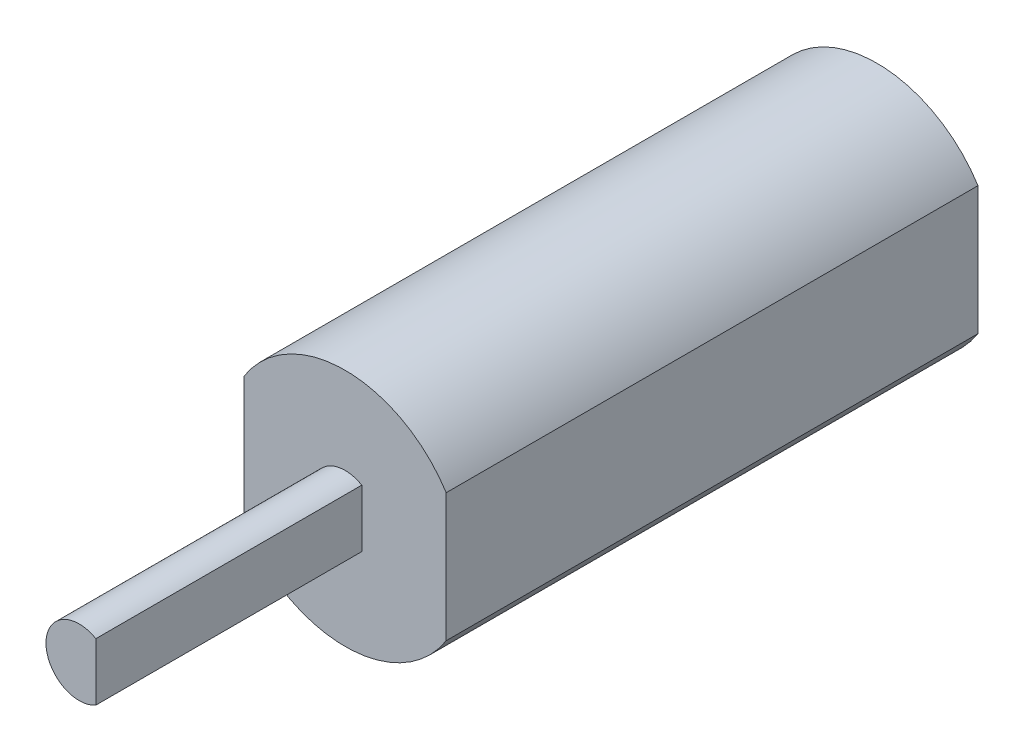
ISO-10303-21;
HEADER;
FILE_DESCRIPTION(('STEP AP214'),'2;1');
FILE_NAME('part.step','',(''),(''),'','','');
FILE_SCHEMA(('AUTOMOTIVE_DESIGN { 1 0 10303 214 1 1 1 1 }'));
ENDSEC;
DATA;
#1=APPLICATION_CONTEXT('core data for automotive mechanical design processes');
#2=APPLICATION_PROTOCOL_DEFINITION('international standard','automotive_design',2000,#1);
#3=PRODUCT_CONTEXT('',#1,'mechanical');
#4=PRODUCT('Part','Part','',(#3));
#5=PRODUCT_RELATED_PRODUCT_CATEGORY('part','',(#4));
#6=PRODUCT_DEFINITION_FORMATION('','',#4);
#7=PRODUCT_DEFINITION_CONTEXT('part definition',#1,'design');
#8=PRODUCT_DEFINITION('design','',#6,#7);
#9=PRODUCT_DEFINITION_SHAPE('','',#8);
#10=(LENGTH_UNIT() NAMED_UNIT(*) SI_UNIT(.MILLI.,.METRE.));
#11=(NAMED_UNIT(*) PLANE_ANGLE_UNIT() SI_UNIT($,.RADIAN.));
#12=(NAMED_UNIT(*) SI_UNIT($,.STERADIAN.) SOLID_ANGLE_UNIT());
#13=UNCERTAINTY_MEASURE_WITH_UNIT(LENGTH_MEASURE(1.E-05),#10,'distance_accuracy_value','');
#14=(GEOMETRIC_REPRESENTATION_CONTEXT(3) GLOBAL_UNCERTAINTY_ASSIGNED_CONTEXT((#13)) GLOBAL_UNIT_ASSIGNED_CONTEXT((#10,
#11,#12)) REPRESENTATION_CONTEXT('',''));
#15=CARTESIAN_POINT('',(0.,0.,0.));
#16=DIRECTION('',(0.,0.,1.));
#17=DIRECTION('',(1.,0.,0.));
#18=AXIS2_PLACEMENT_3D('',#15,#16,#17);
#19=CARTESIAN_POINT('',(0.,0.0167049981378717,25.4));
#20=DIRECTION('',(0.,0.,1.));
#21=DIRECTION('',(1.,0.,0.));
#22=AXIS2_PLACEMENT_3D('',#19,#20,#21);
#23=PLANE('',#22);
#24=DIRECTION('',(0.,1.,0.));
#25=VECTOR('',#24,1.);
#26=CARTESIAN_POINT('',(4.826,0.0167049981378717,25.4));
#27=LINE('',#26,#25);
#28=CARTESIAN_POINT('',(4.826,-3.04449558333339,25.4));
#29=VERTEX_POINT('',#28);
#30=CARTESIAN_POINT('',(4.826,3.07790557960914,25.4));
#31=VERTEX_POINT('',#30);
#32=EDGE_CURVE('E61',#29,#31,#27,.T.);
#33=ORIENTED_EDGE('',*,*,#32,.T.);
#34=CARTESIAN_POINT('',(0.,0.0167049981378717,25.4));
#35=DIRECTION('',(0.,0.,1.));
#36=DIRECTION('',(1.,0.,0.));
#37=AXIS2_PLACEMENT_3D('',#34,#35,#36);
#38=CIRCLE('',#37,5.715);
#39=CARTESIAN_POINT('',(-4.826,3.07790557960914,25.4));
#40=VERTEX_POINT('',#39);
#41=EDGE_CURVE('E90',#31,#40,#38,.T.);
#42=ORIENTED_EDGE('',*,*,#41,.T.);
#43=DIRECTION('',(0.,-1.,0.));
#44=VECTOR('',#43,1.);
#45=CARTESIAN_POINT('',(-4.826,0.0167049981378711,25.4));
#46=LINE('',#45,#44);
#47=CARTESIAN_POINT('',(-4.826,-3.04449558333339,25.4));
#48=VERTEX_POINT('',#47);
#49=EDGE_CURVE('E124',#40,#48,#46,.T.);
#50=ORIENTED_EDGE('',*,*,#49,.T.);
#51=CARTESIAN_POINT('',(0.,0.0167049981378717,25.4));
#52=DIRECTION('',(0.,0.,1.));
#53=DIRECTION('',(1.,0.,0.));
#54=AXIS2_PLACEMENT_3D('',#51,#52,#53);
#55=CIRCLE('',#54,5.715);
#56=EDGE_CURVE('E126',#48,#29,#55,.T.);
#57=ORIENTED_EDGE('',*,*,#56,.T.);
#58=EDGE_LOOP('',(#33,#42,#50,#57));
#59=FACE_BOUND('',#58,.T.);
#60=CARTESIAN_POINT('',(0.,0.,25.4));
#61=DIRECTION('',(0.,0.,1.));
#62=DIRECTION('',(1.,0.,0.));
#63=AXIS2_PLACEMENT_3D('',#60,#61,#62);
#64=CIRCLE('',#63,1.5875);
#65=CARTESIAN_POINT('',(0.79375,1.3748153285078,25.4));
#66=VERTEX_POINT('',#65);
#67=CARTESIAN_POINT('',(0.79375,-1.3748153285078,25.4));
#68=VERTEX_POINT('',#67);
#69=EDGE_CURVE('E106',#66,#68,#64,.T.);
#70=ORIENTED_EDGE('',*,*,#69,.F.);
#71=DIRECTION('',(0.,1.,0.));
#72=VECTOR('',#71,1.);
#73=CARTESIAN_POINT('',(0.79375,0.,25.4));
#74=LINE('',#73,#72);
#75=EDGE_CURVE('E110',#68,#66,#74,.T.);
#76=ORIENTED_EDGE('',*,*,#75,.F.);
#77=EDGE_LOOP('',(#70,#76));
#78=FACE_BOUND('',#77,.T.);
#79=ADVANCED_FACE('F37',(#59,#78),#23,.T.);
#80=CARTESIAN_POINT('',(0.,0.0167049981378717,25.4));
#81=DIRECTION('',(0.,0.,-1.));
#82=DIRECTION('',(-1.,0.,0.));
#83=AXIS2_PLACEMENT_3D('',#80,#81,#82);
#84=CYLINDRICAL_SURFACE('',#83,5.715);
#85=CARTESIAN_POINT('',(0.,0.0167049981378717,0.));
#86=DIRECTION('',(0.,0.,1.));
#87=DIRECTION('',(1.,0.,0.));
#88=AXIS2_PLACEMENT_3D('',#85,#86,#87);
#89=CIRCLE('',#88,5.715);
#90=CARTESIAN_POINT('',(4.826,3.07790557960914,0.));
#91=VERTEX_POINT('',#90);
#92=CARTESIAN_POINT('',(-4.826,3.07790557960914,0.));
#93=VERTEX_POINT('',#92);
#94=EDGE_CURVE('E112',#91,#93,#89,.T.);
#95=ORIENTED_EDGE('',*,*,#94,.T.);
#96=DIRECTION('',(0.,0.,-1.));
#97=VECTOR('',#96,1.);
#98=CARTESIAN_POINT('',(-4.826,3.07790557960914,25.4));
#99=LINE('',#98,#97);
#100=EDGE_CURVE('E45',#40,#93,#99,.T.);
#101=ORIENTED_EDGE('',*,*,#100,.F.);
#102=ORIENTED_EDGE('',*,*,#41,.F.);
#103=DIRECTION('',(0.,0.,-1.));
#104=VECTOR('',#103,1.);
#105=CARTESIAN_POINT('',(4.826,3.07790557960914,25.4));
#106=LINE('',#105,#104);
#107=EDGE_CURVE('E11',#31,#91,#106,.T.);
#108=ORIENTED_EDGE('',*,*,#107,.T.);
#109=EDGE_LOOP('',(#95,#101,#102,#108));
#110=FACE_BOUND('',#109,.T.);
#111=ADVANCED_FACE('F39',(#110),#84,.T.);
#112=CARTESIAN_POINT('',(-4.826,0.0167049981378711,25.4));
#113=DIRECTION('',(1.,0.,0.));
#114=DIRECTION('',(0.,0.,-1.));
#115=AXIS2_PLACEMENT_3D('',#112,#113,#114);
#116=PLANE('',#115);
#117=DIRECTION('',(0.,-1.,0.));
#118=VECTOR('',#117,1.);
#119=CARTESIAN_POINT('',(-4.826,0.0167049981378711,0.));
#120=LINE('',#119,#118);
#121=CARTESIAN_POINT('',(-4.826,-3.04449558333339,0.));
#122=VERTEX_POINT('',#121);
#123=EDGE_CURVE('E131',#93,#122,#120,.T.);
#124=ORIENTED_EDGE('',*,*,#123,.T.);
#125=DIRECTION('',(0.,0.,-1.));
#126=VECTOR('',#125,1.);
#127=CARTESIAN_POINT('',(-4.826,-3.04449558333339,25.4));
#128=LINE('',#127,#126);
#129=EDGE_CURVE('E136',#48,#122,#128,.T.);
#130=ORIENTED_EDGE('',*,*,#129,.F.);
#131=ORIENTED_EDGE('',*,*,#49,.F.);
#132=ORIENTED_EDGE('',*,*,#100,.T.);
#133=EDGE_LOOP('',(#124,#130,#131,#132));
#134=FACE_BOUND('',#133,.T.);
#135=ADVANCED_FACE('F140',(#134),#116,.F.);
#136=CARTESIAN_POINT('',(0.,0.0167049981378717,25.4));
#137=DIRECTION('',(0.,0.,-1.));
#138=DIRECTION('',(-1.,0.,0.));
#139=AXIS2_PLACEMENT_3D('',#136,#137,#138);
#140=CYLINDRICAL_SURFACE('',#139,5.715);
#141=CARTESIAN_POINT('',(0.,0.0167049981378717,0.));
#142=DIRECTION('',(0.,0.,1.));
#143=DIRECTION('',(1.,0.,0.));
#144=AXIS2_PLACEMENT_3D('',#141,#142,#143);
#145=CIRCLE('',#144,5.715);
#146=CARTESIAN_POINT('',(4.826,-3.04449558333339,0.));
#147=VERTEX_POINT('',#146);
#148=EDGE_CURVE('E84',#122,#147,#145,.T.);
#149=ORIENTED_EDGE('',*,*,#148,.T.);
#150=DIRECTION('',(0.,0.,-1.));
#151=VECTOR('',#150,1.);
#152=CARTESIAN_POINT('',(4.826,-3.04449558333339,25.4));
#153=LINE('',#152,#151);
#154=EDGE_CURVE('E128',#29,#147,#153,.T.);
#155=ORIENTED_EDGE('',*,*,#154,.F.);
#156=ORIENTED_EDGE('',*,*,#56,.F.);
#157=ORIENTED_EDGE('',*,*,#129,.T.);
#158=EDGE_LOOP('',(#149,#155,#156,#157));
#159=FACE_BOUND('',#158,.T.);
#160=ADVANCED_FACE('F148',(#159),#140,.T.);
#161=CARTESIAN_POINT('',(4.826,0.0167049981378717,25.4));
#162=DIRECTION('',(-1.,0.,0.));
#163=DIRECTION('',(0.,0.,1.));
#164=AXIS2_PLACEMENT_3D('',#161,#162,#163);
#165=PLANE('',#164);
#166=DIRECTION('',(0.,1.,0.));
#167=VECTOR('',#166,1.);
#168=CARTESIAN_POINT('',(4.826,0.0167049981378717,0.));
#169=LINE('',#168,#167);
#170=EDGE_CURVE('E122',#147,#91,#169,.T.);
#171=ORIENTED_EDGE('',*,*,#170,.T.);
#172=ORIENTED_EDGE('',*,*,#107,.F.);
#173=ORIENTED_EDGE('',*,*,#32,.F.);
#174=ORIENTED_EDGE('',*,*,#154,.T.);
#175=EDGE_LOOP('',(#171,#172,#173,#174));
#176=FACE_BOUND('',#175,.T.);
#177=ADVANCED_FACE('F146',(#176),#165,.F.);
#178=CARTESIAN_POINT('',(0.,0.0167049981378717,0.));
#179=DIRECTION('',(0.,0.,1.));
#180=DIRECTION('',(1.,0.,0.));
#181=AXIS2_PLACEMENT_3D('',#178,#179,#180);
#182=PLANE('',#181);
#183=ORIENTED_EDGE('',*,*,#94,.F.);
#184=ORIENTED_EDGE('',*,*,#170,.F.);
#185=ORIENTED_EDGE('',*,*,#148,.F.);
#186=ORIENTED_EDGE('',*,*,#123,.F.);
#187=EDGE_LOOP('',(#183,#184,#185,#186));
#188=FACE_BOUND('',#187,.T.);
#189=ADVANCED_FACE('F145',(#188),#182,.F.);
#190=CARTESIAN_POINT('',(0.79375,0.,38.1));
#191=DIRECTION('',(-1.,0.,0.));
#192=DIRECTION('',(0.,0.,1.));
#193=AXIS2_PLACEMENT_3D('',#190,#191,#192);
#194=PLANE('',#193);
#195=ORIENTED_EDGE('',*,*,#75,.T.);
#196=DIRECTION('',(0.,0.,-1.));
#197=VECTOR('',#196,1.);
#198=CARTESIAN_POINT('',(0.79375,1.3748153285078,38.1));
#199=LINE('',#198,#197);
#200=CARTESIAN_POINT('',(0.79375,1.3748153285078,38.1));
#201=VERTEX_POINT('',#200);
#202=EDGE_CURVE('E52',#201,#66,#199,.T.);
#203=ORIENTED_EDGE('',*,*,#202,.F.);
#204=DIRECTION('',(0.,1.,0.));
#205=VECTOR('',#204,1.);
#206=CARTESIAN_POINT('',(0.79375,0.,38.1));
#207=LINE('',#206,#205);
#208=CARTESIAN_POINT('',(0.79375,-1.3748153285078,38.1));
#209=VERTEX_POINT('',#208);
#210=EDGE_CURVE('E100',#209,#201,#207,.T.);
#211=ORIENTED_EDGE('',*,*,#210,.F.);
#212=DIRECTION('',(0.,0.,-1.));
#213=VECTOR('',#212,1.);
#214=CARTESIAN_POINT('',(0.79375,-1.3748153285078,38.1));
#215=LINE('',#214,#213);
#216=EDGE_CURVE('E113',#209,#68,#215,.T.);
#217=ORIENTED_EDGE('',*,*,#216,.T.);
#218=EDGE_LOOP('',(#195,#203,#211,#217));
#219=FACE_BOUND('',#218,.T.);
#220=ADVANCED_FACE('F108',(#219),#194,.F.);
#221=CARTESIAN_POINT('',(0.,0.,38.1));
#222=DIRECTION('',(0.,0.,-1.));
#223=DIRECTION('',(-1.,0.,0.));
#224=AXIS2_PLACEMENT_3D('',#221,#222,#223);
#225=CYLINDRICAL_SURFACE('',#224,1.5875);
#226=ORIENTED_EDGE('',*,*,#69,.T.);
#227=ORIENTED_EDGE('',*,*,#216,.F.);
#228=CARTESIAN_POINT('',(0.,0.,38.1));
#229=DIRECTION('',(0.,0.,1.));
#230=DIRECTION('',(1.,0.,0.));
#231=AXIS2_PLACEMENT_3D('',#228,#229,#230);
#232=CIRCLE('',#231,1.5875);
#233=EDGE_CURVE('E102',#201,#209,#232,.T.);
#234=ORIENTED_EDGE('',*,*,#233,.F.);
#235=ORIENTED_EDGE('',*,*,#202,.T.);
#236=EDGE_LOOP('',(#226,#227,#234,#235));
#237=FACE_BOUND('',#236,.T.);
#238=ADVANCED_FACE('F115',(#237),#225,.T.);
#239=CARTESIAN_POINT('',(0.,0.,38.1));
#240=DIRECTION('',(0.,0.,1.));
#241=DIRECTION('',(1.,0.,0.));
#242=AXIS2_PLACEMENT_3D('',#239,#240,#241);
#243=PLANE('',#242);
#244=ORIENTED_EDGE('',*,*,#210,.T.);
#245=ORIENTED_EDGE('',*,*,#233,.T.);
#246=EDGE_LOOP('',(#244,#245));
#247=FACE_BOUND('',#246,.T.);
#248=ADVANCED_FACE('F101',(#247),#243,.T.);
#249=CLOSED_SHELL('',(#79,#111,#135,#160,#177,#189,#220,#238,#248));
#250=MANIFOLD_SOLID_BREP('B2',#249);
#251=ADVANCED_BREP_SHAPE_REPRESENTATION('',(#18,#250),#14);
#252=SHAPE_DEFINITION_REPRESENTATION(#9,#251);
ENDSEC;
END-ISO-10303-21;
